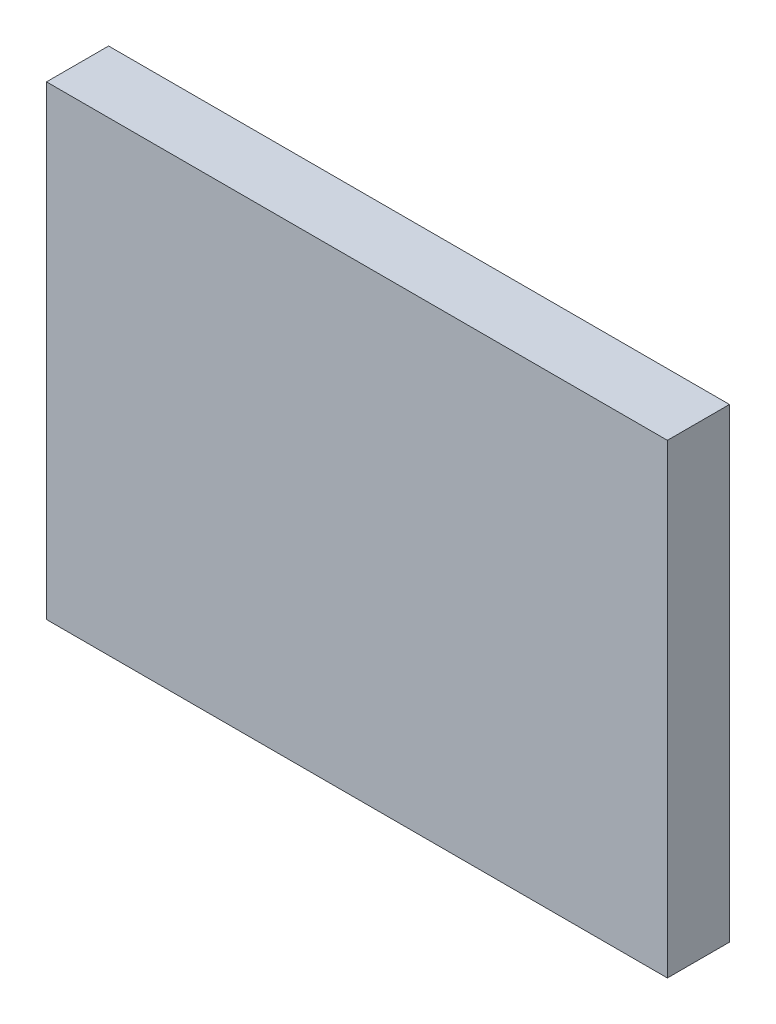
ISO-10303-21;
HEADER;
FILE_DESCRIPTION(('STEP AP214'),'2;1');
FILE_NAME('part.step','',(''),(''),'','','');
FILE_SCHEMA(('AUTOMOTIVE_DESIGN { 1 0 10303 214 1 1 1 1 }'));
ENDSEC;
DATA;
#1=APPLICATION_CONTEXT('core data for automotive mechanical design processes');
#2=APPLICATION_PROTOCOL_DEFINITION('international standard','automotive_design',2000,#1);
#3=PRODUCT_CONTEXT('',#1,'mechanical');
#4=PRODUCT('Part','Part','',(#3));
#5=PRODUCT_RELATED_PRODUCT_CATEGORY('part','',(#4));
#6=PRODUCT_DEFINITION_FORMATION('','',#4);
#7=PRODUCT_DEFINITION_CONTEXT('part definition',#1,'design');
#8=PRODUCT_DEFINITION('design','',#6,#7);
#9=PRODUCT_DEFINITION_SHAPE('','',#8);
#10=(LENGTH_UNIT() NAMED_UNIT(*) SI_UNIT(.MILLI.,.METRE.));
#11=(NAMED_UNIT(*) PLANE_ANGLE_UNIT() SI_UNIT($,.RADIAN.));
#12=(NAMED_UNIT(*) SI_UNIT($,.STERADIAN.) SOLID_ANGLE_UNIT());
#13=UNCERTAINTY_MEASURE_WITH_UNIT(LENGTH_MEASURE(1.E-05),#10,'distance_accuracy_value','');
#14=(GEOMETRIC_REPRESENTATION_CONTEXT(3) GLOBAL_UNCERTAINTY_ASSIGNED_CONTEXT((#13)) GLOBAL_UNIT_ASSIGNED_CONTEXT((#10,
#11,#12)) REPRESENTATION_CONTEXT('',''));
#15=CARTESIAN_POINT('',(0.,0.,0.));
#16=DIRECTION('',(0.,0.,1.));
#17=DIRECTION('',(1.,0.,0.));
#18=AXIS2_PLACEMENT_3D('',#15,#16,#17);
#19=CARTESIAN_POINT('',(0.,0.,2.54));
#20=DIRECTION('',(1.,0.,0.));
#21=DIRECTION('',(0.,0.,-1.));
#22=AXIS2_PLACEMENT_3D('',#19,#20,#21);
#23=PLANE('',#22);
#24=DIRECTION('',(0.,-1.,0.));
#25=VECTOR('',#24,1.);
#26=CARTESIAN_POINT('',(0.,0.,0.));
#27=LINE('',#26,#25);
#28=CARTESIAN_POINT('',(0.,19.05,0.));
#29=VERTEX_POINT('',#28);
#30=CARTESIAN_POINT('',(0.,0.,0.));
#31=VERTEX_POINT('',#30);
#32=EDGE_CURVE('E96',#29,#31,#27,.T.);
#33=ORIENTED_EDGE('',*,*,#32,.T.);
#34=DIRECTION('',(0.,0.,-1.));
#35=VECTOR('',#34,1.);
#36=CARTESIAN_POINT('',(0.,0.,2.54));
#37=LINE('',#36,#35);
#38=CARTESIAN_POINT('',(0.,0.,2.54));
#39=VERTEX_POINT('',#38);
#40=EDGE_CURVE('E11',#39,#31,#37,.T.);
#41=ORIENTED_EDGE('',*,*,#40,.F.);
#42=DIRECTION('',(0.,-1.,0.));
#43=VECTOR('',#42,1.);
#44=CARTESIAN_POINT('',(0.,0.,2.54));
#45=LINE('',#44,#43);
#46=CARTESIAN_POINT('',(0.,19.05,2.54));
#47=VERTEX_POINT('',#46);
#48=EDGE_CURVE('E84',#47,#39,#45,.T.);
#49=ORIENTED_EDGE('',*,*,#48,.F.);
#50=DIRECTION('',(0.,0.,-1.));
#51=VECTOR('',#50,1.);
#52=CARTESIAN_POINT('',(0.,19.05,2.54));
#53=LINE('',#52,#51);
#54=EDGE_CURVE('E92',#47,#29,#53,.T.);
#55=ORIENTED_EDGE('',*,*,#54,.T.);
#56=EDGE_LOOP('',(#33,#41,#49,#55));
#57=FACE_BOUND('',#56,.T.);
#58=ADVANCED_FACE('F33',(#57),#23,.F.);
#59=CARTESIAN_POINT('',(0.,0.,2.54));
#60=DIRECTION('',(0.,1.,0.));
#61=DIRECTION('',(0.,0.,1.));
#62=AXIS2_PLACEMENT_3D('',#59,#60,#61);
#63=PLANE('',#62);
#64=DIRECTION('',(1.,0.,0.));
#65=VECTOR('',#64,1.);
#66=CARTESIAN_POINT('',(0.,0.,0.));
#67=LINE('',#66,#65);
#68=CARTESIAN_POINT('',(25.4,0.,0.));
#69=VERTEX_POINT('',#68);
#70=EDGE_CURVE('E88',#31,#69,#67,.T.);
#71=ORIENTED_EDGE('',*,*,#70,.T.);
#72=DIRECTION('',(0.,0.,-1.));
#73=VECTOR('',#72,1.);
#74=CARTESIAN_POINT('',(25.4,0.,2.54));
#75=LINE('',#74,#73);
#76=CARTESIAN_POINT('',(25.4,0.,2.54));
#77=VERTEX_POINT('',#76);
#78=EDGE_CURVE('E41',#77,#69,#75,.T.);
#79=ORIENTED_EDGE('',*,*,#78,.F.);
#80=DIRECTION('',(1.,0.,0.));
#81=VECTOR('',#80,1.);
#82=CARTESIAN_POINT('',(0.,0.,2.54));
#83=LINE('',#82,#81);
#84=EDGE_CURVE('E79',#39,#77,#83,.T.);
#85=ORIENTED_EDGE('',*,*,#84,.F.);
#86=ORIENTED_EDGE('',*,*,#40,.T.);
#87=EDGE_LOOP('',(#71,#79,#85,#86));
#88=FACE_BOUND('',#87,.T.);
#89=ADVANCED_FACE('F87',(#88),#63,.F.);
#90=CARTESIAN_POINT('',(25.4,0.,2.54));
#91=DIRECTION('',(-1.,0.,0.));
#92=DIRECTION('',(0.,0.,1.));
#93=AXIS2_PLACEMENT_3D('',#90,#91,#92);
#94=PLANE('',#93);
#95=DIRECTION('',(0.,1.,0.));
#96=VECTOR('',#95,1.);
#97=CARTESIAN_POINT('',(25.4,0.,0.));
#98=LINE('',#97,#96);
#99=CARTESIAN_POINT('',(25.4,19.05,0.));
#100=VERTEX_POINT('',#99);
#101=EDGE_CURVE('E66',#69,#100,#98,.T.);
#102=ORIENTED_EDGE('',*,*,#101,.T.);
#103=DIRECTION('',(0.,0.,-1.));
#104=VECTOR('',#103,1.);
#105=CARTESIAN_POINT('',(25.4,19.05,2.54));
#106=LINE('',#105,#104);
#107=CARTESIAN_POINT('',(25.4,19.05,2.54));
#108=VERTEX_POINT('',#107);
#109=EDGE_CURVE('E89',#108,#100,#106,.T.);
#110=ORIENTED_EDGE('',*,*,#109,.F.);
#111=DIRECTION('',(0.,1.,0.));
#112=VECTOR('',#111,1.);
#113=CARTESIAN_POINT('',(25.4,0.,2.54));
#114=LINE('',#113,#112);
#115=EDGE_CURVE('E82',#77,#108,#114,.T.);
#116=ORIENTED_EDGE('',*,*,#115,.F.);
#117=ORIENTED_EDGE('',*,*,#78,.T.);
#118=EDGE_LOOP('',(#102,#110,#116,#117));
#119=FACE_BOUND('',#118,.T.);
#120=ADVANCED_FACE('F90',(#119),#94,.F.);
#121=CARTESIAN_POINT('',(0.,19.05,2.54));
#122=DIRECTION('',(0.,-1.,0.));
#123=DIRECTION('',(0.,0.,-1.));
#124=AXIS2_PLACEMENT_3D('',#121,#122,#123);
#125=PLANE('',#124);
#126=DIRECTION('',(-1.,0.,0.));
#127=VECTOR('',#126,1.);
#128=CARTESIAN_POINT('',(0.,19.05,0.));
#129=LINE('',#128,#127);
#130=EDGE_CURVE('E72',#100,#29,#129,.T.);
#131=ORIENTED_EDGE('',*,*,#130,.T.);
#132=ORIENTED_EDGE('',*,*,#54,.F.);
#133=DIRECTION('',(-1.,0.,0.));
#134=VECTOR('',#133,1.);
#135=CARTESIAN_POINT('',(0.,19.05,2.54));
#136=LINE('',#135,#134);
#137=EDGE_CURVE('E49',#108,#47,#136,.T.);
#138=ORIENTED_EDGE('',*,*,#137,.F.);
#139=ORIENTED_EDGE('',*,*,#109,.T.);
#140=EDGE_LOOP('',(#131,#132,#138,#139));
#141=FACE_BOUND('',#140,.T.);
#142=ADVANCED_FACE('F103',(#141),#125,.F.);
#143=CARTESIAN_POINT('',(0.,0.,2.54));
#144=DIRECTION('',(0.,0.,-1.));
#145=DIRECTION('',(-1.,0.,0.));
#146=AXIS2_PLACEMENT_3D('',#143,#144,#145);
#147=PLANE('',#146);
#148=ORIENTED_EDGE('',*,*,#48,.T.);
#149=ORIENTED_EDGE('',*,*,#84,.T.);
#150=ORIENTED_EDGE('',*,*,#115,.T.);
#151=ORIENTED_EDGE('',*,*,#137,.T.);
#152=EDGE_LOOP('',(#148,#149,#150,#151));
#153=FACE_BOUND('',#152,.T.);
#154=ADVANCED_FACE('F80',(#153),#147,.F.);
#155=CARTESIAN_POINT('',(0.,0.,0.));
#156=DIRECTION('',(0.,0.,-1.));
#157=DIRECTION('',(-1.,0.,0.));
#158=AXIS2_PLACEMENT_3D('',#155,#156,#157);
#159=PLANE('',#158);
#160=ORIENTED_EDGE('',*,*,#32,.F.);
#161=ORIENTED_EDGE('',*,*,#130,.F.);
#162=ORIENTED_EDGE('',*,*,#101,.F.);
#163=ORIENTED_EDGE('',*,*,#70,.F.);
#164=EDGE_LOOP('',(#160,#161,#162,#163));
#165=FACE_BOUND('',#164,.T.);
#166=ADVANCED_FACE('F106',(#165),#159,.T.);
#167=CLOSED_SHELL('',(#58,#89,#120,#142,#154,#166));
#168=MANIFOLD_SOLID_BREP('B2',#167);
#169=ADVANCED_BREP_SHAPE_REPRESENTATION('',(#18,#168),#14);
#170=SHAPE_DEFINITION_REPRESENTATION(#9,#169);
ENDSEC;
END-ISO-10303-21;
